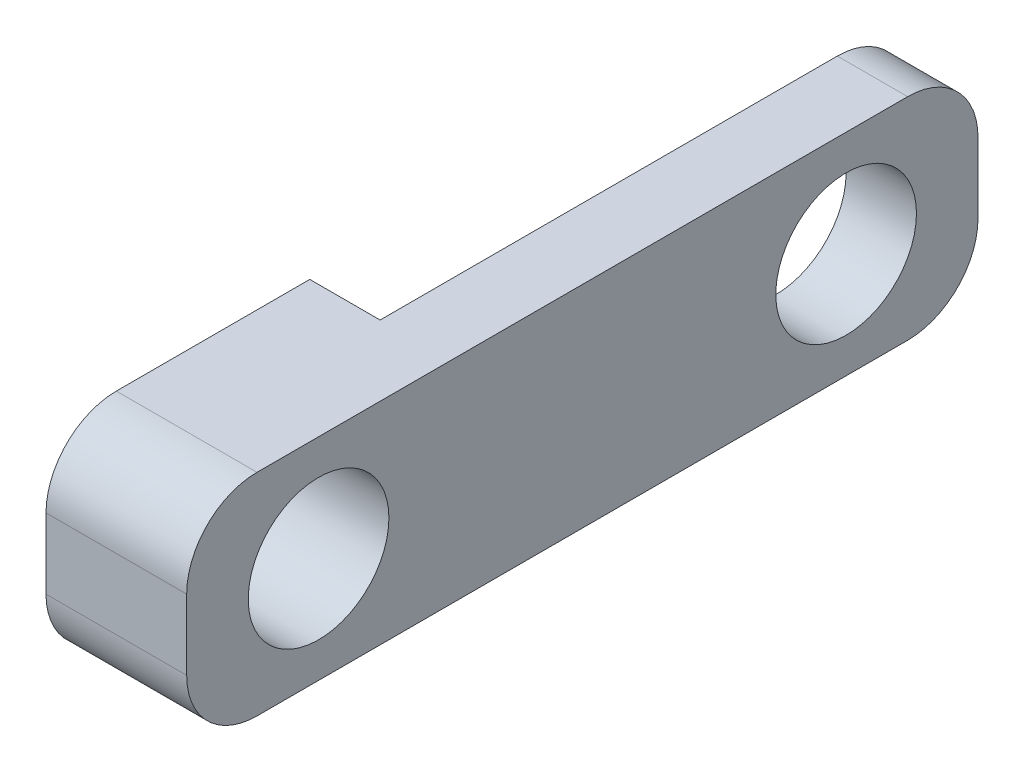
ISO-10303-21;
HEADER;
FILE_DESCRIPTION(('STEP AP214'),'2;1');
FILE_NAME('part.step','',(''),(''),'','','');
FILE_SCHEMA(('AUTOMOTIVE_DESIGN { 1 0 10303 214 1 1 1 1 }'));
ENDSEC;
DATA;
#1=APPLICATION_CONTEXT('core data for automotive mechanical design processes');
#2=APPLICATION_PROTOCOL_DEFINITION('international standard','automotive_design',2000,#1);
#3=PRODUCT_CONTEXT('',#1,'mechanical');
#4=PRODUCT('Part','Part','',(#3));
#5=PRODUCT_RELATED_PRODUCT_CATEGORY('part','',(#4));
#6=PRODUCT_DEFINITION_FORMATION('','',#4);
#7=PRODUCT_DEFINITION_CONTEXT('part definition',#1,'design');
#8=PRODUCT_DEFINITION('design','',#6,#7);
#9=PRODUCT_DEFINITION_SHAPE('','',#8);
#10=(LENGTH_UNIT() NAMED_UNIT(*) SI_UNIT(.MILLI.,.METRE.));
#11=(NAMED_UNIT(*) PLANE_ANGLE_UNIT() SI_UNIT($,.RADIAN.));
#12=(NAMED_UNIT(*) SI_UNIT($,.STERADIAN.) SOLID_ANGLE_UNIT());
#13=UNCERTAINTY_MEASURE_WITH_UNIT(LENGTH_MEASURE(1.E-05),#10,'distance_accuracy_value','');
#14=(GEOMETRIC_REPRESENTATION_CONTEXT(3) GLOBAL_UNCERTAINTY_ASSIGNED_CONTEXT((#13)) GLOBAL_UNIT_ASSIGNED_CONTEXT((#10,
#11,#12)) REPRESENTATION_CONTEXT('',''));
#15=CARTESIAN_POINT('',(0.,0.,0.));
#16=DIRECTION('',(0.,0.,1.));
#17=DIRECTION('',(1.,0.,0.));
#18=AXIS2_PLACEMENT_3D('',#15,#16,#17);
#19=CARTESIAN_POINT('',(8.,6.,-22.5));
#20=DIRECTION('',(0.,0.,1.));
#21=DIRECTION('',(1.,0.,0.));
#22=AXIS2_PLACEMENT_3D('',#19,#20,#21);
#23=PLANE('',#22);
#24=DIRECTION('',(-1.,0.,0.));
#25=VECTOR('',#24,1.);
#26=CARTESIAN_POINT('',(8.,-2.,-22.5));
#27=LINE('',#26,#25);
#28=CARTESIAN_POINT('',(8.,-2.,-22.5));
#29=VERTEX_POINT('',#28);
#30=CARTESIAN_POINT('',(4.,-2.,-22.5));
#31=VERTEX_POINT('',#30);
#32=EDGE_CURVE('E164',#29,#31,#27,.T.);
#33=ORIENTED_EDGE('',*,*,#32,.T.);
#34=DIRECTION('',(0.,1.,0.));
#35=VECTOR('',#34,1.);
#36=CARTESIAN_POINT('',(4.,6.,-22.5));
#37=LINE('',#36,#35);
#38=CARTESIAN_POINT('',(4.,2.,-22.5));
#39=VERTEX_POINT('',#38);
#40=EDGE_CURVE('E212',#31,#39,#37,.T.);
#41=ORIENTED_EDGE('',*,*,#40,.T.);
#42=DIRECTION('',(-1.,0.,0.));
#43=VECTOR('',#42,1.);
#44=CARTESIAN_POINT('',(8.,2.,-22.5));
#45=LINE('',#44,#43);
#46=CARTESIAN_POINT('',(8.,2.,-22.5));
#47=VERTEX_POINT('',#46);
#48=EDGE_CURVE('E161',#39,#47,#45,.F.);
#49=ORIENTED_EDGE('',*,*,#48,.T.);
#50=DIRECTION('',(0.,1.,0.));
#51=VECTOR('',#50,1.);
#52=CARTESIAN_POINT('',(8.,6.,-22.5));
#53=LINE('',#52,#51);
#54=EDGE_CURVE('E160',#29,#47,#53,.T.);
#55=ORIENTED_EDGE('',*,*,#54,.F.);
#56=EDGE_LOOP('',(#33,#41,#49,#55));
#57=FACE_BOUND('',#56,.T.);
#58=ADVANCED_FACE('F39',(#57),#23,.F.);
#59=CARTESIAN_POINT('',(8.,6.,22.5));
#60=DIRECTION('',(0.,-1.,0.));
#61=DIRECTION('',(0.,0.,-1.));
#62=AXIS2_PLACEMENT_3D('',#59,#60,#61);
#63=PLANE('',#62);
#64=DIRECTION('',(-1.,0.,0.));
#65=VECTOR('',#64,1.);
#66=CARTESIAN_POINT('',(8.,6.,-18.5));
#67=LINE('',#66,#65);
#68=CARTESIAN_POINT('',(8.,6.,-18.5));
#69=VERTEX_POINT('',#68);
#70=CARTESIAN_POINT('',(4.,6.,-18.5));
#71=VERTEX_POINT('',#70);
#72=EDGE_CURVE('E48',#69,#71,#67,.T.);
#73=ORIENTED_EDGE('',*,*,#72,.T.);
#74=DIRECTION('',(0.,0.,-1.));
#75=VECTOR('',#74,1.);
#76=CARTESIAN_POINT('',(4.,6.,7.49999999999999));
#77=LINE('',#76,#75);
#78=CARTESIAN_POINT('',(4.,6.,7.49999999999999));
#79=VERTEX_POINT('',#78);
#80=EDGE_CURVE('E54',#79,#71,#77,.T.);
#81=ORIENTED_EDGE('',*,*,#80,.F.);
#82=DIRECTION('',(1.,0.,0.));
#83=VECTOR('',#82,1.);
#84=CARTESIAN_POINT('',(4.,6.,7.49999999999999));
#85=LINE('',#84,#83);
#86=CARTESIAN_POINT('',(0.,6.,7.49999999999999));
#87=VERTEX_POINT('',#86);
#88=EDGE_CURVE('E122',#87,#79,#85,.T.);
#89=ORIENTED_EDGE('',*,*,#88,.F.);
#90=DIRECTION('',(0.,0.,1.));
#91=VECTOR('',#90,1.);
#92=CARTESIAN_POINT('',(0.,6.,22.5));
#93=LINE('',#92,#91);
#94=CARTESIAN_POINT('',(0.,6.,18.5));
#95=VERTEX_POINT('',#94);
#96=EDGE_CURVE('E135',#87,#95,#93,.T.);
#97=ORIENTED_EDGE('',*,*,#96,.T.);
#98=DIRECTION('',(-1.,0.,0.));
#99=VECTOR('',#98,1.);
#100=CARTESIAN_POINT('',(8.,6.,18.5));
#101=LINE('',#100,#99);
#102=CARTESIAN_POINT('',(8.,6.,18.5));
#103=VERTEX_POINT('',#102);
#104=EDGE_CURVE('E198',#95,#103,#101,.F.);
#105=ORIENTED_EDGE('',*,*,#104,.T.);
#106=DIRECTION('',(0.,0.,1.));
#107=VECTOR('',#106,1.);
#108=CARTESIAN_POINT('',(8.,6.,22.5));
#109=LINE('',#108,#107);
#110=EDGE_CURVE('E204',#69,#103,#109,.T.);
#111=ORIENTED_EDGE('',*,*,#110,.F.);
#112=EDGE_LOOP('',(#73,#81,#89,#97,#105,#111));
#113=FACE_BOUND('',#112,.T.);
#114=ADVANCED_FACE('F134',(#113),#63,.F.);
#115=CARTESIAN_POINT('',(8.,6.,22.5));
#116=DIRECTION('',(0.,0.,-1.));
#117=DIRECTION('',(-1.,0.,0.));
#118=AXIS2_PLACEMENT_3D('',#115,#116,#117);
#119=PLANE('',#118);
#120=DIRECTION('',(0.,-1.,0.));
#121=VECTOR('',#120,1.);
#122=CARTESIAN_POINT('',(0.,6.,22.5));
#123=LINE('',#122,#121);
#124=CARTESIAN_POINT('',(0.,2.,22.5));
#125=VERTEX_POINT('',#124);
#126=CARTESIAN_POINT('',(0.,-2.,22.5));
#127=VERTEX_POINT('',#126);
#128=EDGE_CURVE('E144',#125,#127,#123,.T.);
#129=ORIENTED_EDGE('',*,*,#128,.T.);
#130=DIRECTION('',(-1.,0.,0.));
#131=VECTOR('',#130,1.);
#132=CARTESIAN_POINT('',(8.,-2.,22.5));
#133=LINE('',#132,#131);
#134=CARTESIAN_POINT('',(8.,-2.,22.5));
#135=VERTEX_POINT('',#134);
#136=EDGE_CURVE('E62',#127,#135,#133,.F.);
#137=ORIENTED_EDGE('',*,*,#136,.T.);
#138=DIRECTION('',(0.,-1.,0.));
#139=VECTOR('',#138,1.);
#140=CARTESIAN_POINT('',(8.,6.,22.5));
#141=LINE('',#140,#139);
#142=CARTESIAN_POINT('',(8.,2.,22.5));
#143=VERTEX_POINT('',#142);
#144=EDGE_CURVE('E246',#143,#135,#141,.T.);
#145=ORIENTED_EDGE('',*,*,#144,.F.);
#146=DIRECTION('',(-1.,0.,0.));
#147=VECTOR('',#146,1.);
#148=CARTESIAN_POINT('',(8.,2.,22.5));
#149=LINE('',#148,#147);
#150=EDGE_CURVE('E192',#143,#125,#149,.T.);
#151=ORIENTED_EDGE('',*,*,#150,.T.);
#152=EDGE_LOOP('',(#129,#137,#145,#151));
#153=FACE_BOUND('',#152,.T.);
#154=ADVANCED_FACE('F262',(#153),#119,.F.);
#155=CARTESIAN_POINT('',(8.,-6.,22.5));
#156=DIRECTION('',(0.,1.,0.));
#157=DIRECTION('',(0.,0.,1.));
#158=AXIS2_PLACEMENT_3D('',#155,#156,#157);
#159=PLANE('',#158);
#160=DIRECTION('',(1.,0.,0.));
#161=VECTOR('',#160,1.);
#162=CARTESIAN_POINT('',(7.99999999999999,-6.,7.49999999999999));
#163=LINE('',#162,#161);
#164=CARTESIAN_POINT('',(0.,-6.,7.49999999999999));
#165=VERTEX_POINT('',#164);
#166=CARTESIAN_POINT('',(4.,-6.,7.49999999999999));
#167=VERTEX_POINT('',#166);
#168=EDGE_CURVE('E124',#165,#167,#163,.T.);
#169=ORIENTED_EDGE('',*,*,#168,.T.);
#170=DIRECTION('',(0.,0.,-1.));
#171=VECTOR('',#170,1.);
#172=CARTESIAN_POINT('',(4.,-6.,22.5));
#173=LINE('',#172,#171);
#174=CARTESIAN_POINT('',(4.,-6.,-18.5));
#175=VERTEX_POINT('',#174);
#176=EDGE_CURVE('E223',#167,#175,#173,.T.);
#177=ORIENTED_EDGE('',*,*,#176,.T.);
#178=DIRECTION('',(-1.,0.,0.));
#179=VECTOR('',#178,1.);
#180=CARTESIAN_POINT('',(8.,-6.,-18.5));
#181=LINE('',#180,#179);
#182=CARTESIAN_POINT('',(8.,-6.,-18.5));
#183=VERTEX_POINT('',#182);
#184=EDGE_CURVE('E177',#175,#183,#181,.F.);
#185=ORIENTED_EDGE('',*,*,#184,.T.);
#186=DIRECTION('',(0.,0.,-1.));
#187=VECTOR('',#186,1.);
#188=CARTESIAN_POINT('',(8.,-6.,22.5));
#189=LINE('',#188,#187);
#190=CARTESIAN_POINT('',(8.,-6.,18.5));
#191=VERTEX_POINT('',#190);
#192=EDGE_CURVE('E155',#191,#183,#189,.T.);
#193=ORIENTED_EDGE('',*,*,#192,.F.);
#194=DIRECTION('',(-1.,0.,0.));
#195=VECTOR('',#194,1.);
#196=CARTESIAN_POINT('',(8.,-6.,18.5));
#197=LINE('',#196,#195);
#198=CARTESIAN_POINT('',(0.,-6.,18.5));
#199=VERTEX_POINT('',#198);
#200=EDGE_CURVE('E173',#191,#199,#197,.T.);
#201=ORIENTED_EDGE('',*,*,#200,.T.);
#202=DIRECTION('',(0.,0.,-1.));
#203=VECTOR('',#202,1.);
#204=CARTESIAN_POINT('',(0.,-6.,22.5));
#205=LINE('',#204,#203);
#206=EDGE_CURVE('E149',#199,#165,#205,.T.);
#207=ORIENTED_EDGE('',*,*,#206,.T.);
#208=EDGE_LOOP('',(#169,#177,#185,#193,#201,#207));
#209=FACE_BOUND('',#208,.T.);
#210=ADVANCED_FACE('F260',(#209),#159,.F.);
#211=CARTESIAN_POINT('',(8.,0.,0.));
#212=DIRECTION('',(1.,0.,0.));
#213=DIRECTION('',(0.,0.,-1.));
#214=AXIS2_PLACEMENT_3D('',#211,#212,#213);
#215=PLANE('',#214);
#216=CARTESIAN_POINT('',(8.,0.,15.));
#217=DIRECTION('',(1.,0.,0.));
#218=DIRECTION('',(0.,0.,-1.));
#219=AXIS2_PLACEMENT_3D('',#216,#217,#218);
#220=CIRCLE('',#219,4.);
#221=CARTESIAN_POINT('',(8.,0.,11.));
#222=VERTEX_POINT('',#221);
#223=EDGE_CURVE('E152',#222,#222,#220,.T.);
#224=ORIENTED_EDGE('',*,*,#223,.F.);
#225=EDGE_LOOP('',(#224));
#226=FACE_BOUND('',#225,.T.);
#227=CARTESIAN_POINT('',(8.,0.,-15.));
#228=DIRECTION('',(1.,0.,0.));
#229=DIRECTION('',(0.,0.,-1.));
#230=AXIS2_PLACEMENT_3D('',#227,#228,#229);
#231=CIRCLE('',#230,4.);
#232=CARTESIAN_POINT('',(8.,0.,-19.));
#233=VERTEX_POINT('',#232);
#234=EDGE_CURVE('E235',#233,#233,#231,.T.);
#235=ORIENTED_EDGE('',*,*,#234,.F.);
#236=EDGE_LOOP('',(#235));
#237=FACE_BOUND('',#236,.T.);
#238=ORIENTED_EDGE('',*,*,#192,.T.);
#239=CARTESIAN_POINT('',(8.,-2.,-18.5));
#240=DIRECTION('',(1.,0.,0.));
#241=DIRECTION('',(0.,0.,-1.));
#242=AXIS2_PLACEMENT_3D('',#239,#240,#241);
#243=CIRCLE('',#242,4.);
#244=EDGE_CURVE('E189',#183,#29,#243,.T.);
#245=ORIENTED_EDGE('',*,*,#244,.T.);
#246=ORIENTED_EDGE('',*,*,#54,.T.);
#247=CARTESIAN_POINT('',(8.,2.,-18.5));
#248=DIRECTION('',(1.,0.,0.));
#249=DIRECTION('',(0.,0.,-1.));
#250=AXIS2_PLACEMENT_3D('',#247,#248,#249);
#251=CIRCLE('',#250,4.);
#252=EDGE_CURVE('E183',#47,#69,#251,.T.);
#253=ORIENTED_EDGE('',*,*,#252,.T.);
#254=ORIENTED_EDGE('',*,*,#110,.T.);
#255=CARTESIAN_POINT('',(8.,2.,18.5));
#256=DIRECTION('',(1.,0.,0.));
#257=DIRECTION('',(0.,0.,-1.));
#258=AXIS2_PLACEMENT_3D('',#255,#256,#257);
#259=CIRCLE('',#258,4.);
#260=EDGE_CURVE('E180',#103,#143,#259,.T.);
#261=ORIENTED_EDGE('',*,*,#260,.T.);
#262=ORIENTED_EDGE('',*,*,#144,.T.);
#263=CARTESIAN_POINT('',(8.,-2.,18.5));
#264=DIRECTION('',(1.,0.,0.));
#265=DIRECTION('',(0.,0.,-1.));
#266=AXIS2_PLACEMENT_3D('',#263,#264,#265);
#267=CIRCLE('',#266,4.);
#268=EDGE_CURVE('E186',#135,#191,#267,.T.);
#269=ORIENTED_EDGE('',*,*,#268,.T.);
#270=EDGE_LOOP('',(#238,#245,#246,#253,#254,#261,#262,#269));
#271=FACE_BOUND('',#270,.T.);
#272=ADVANCED_FACE('F254',(#226,#237,#271),#215,.T.);
#273=CARTESIAN_POINT('',(0.,0.,0.));
#274=DIRECTION('',(1.,0.,0.));
#275=DIRECTION('',(0.,0.,-1.));
#276=AXIS2_PLACEMENT_3D('',#273,#274,#275);
#277=PLANE('',#276);
#278=CARTESIAN_POINT('',(0.,0.,15.));
#279=DIRECTION('',(1.,0.,0.));
#280=DIRECTION('',(0.,0.,-1.));
#281=AXIS2_PLACEMENT_3D('',#278,#279,#280);
#282=CIRCLE('',#281,4.);
#283=CARTESIAN_POINT('',(0.,0.,11.));
#284=VERTEX_POINT('',#283);
#285=EDGE_CURVE('E145',#284,#284,#282,.T.);
#286=ORIENTED_EDGE('',*,*,#285,.T.);
#287=EDGE_LOOP('',(#286));
#288=FACE_BOUND('',#287,.T.);
#289=ORIENTED_EDGE('',*,*,#96,.F.);
#290=DIRECTION('',(0.,1.,0.));
#291=VECTOR('',#290,1.);
#292=CARTESIAN_POINT('',(0.,-10.,7.49999999999999));
#293=LINE('',#292,#291);
#294=EDGE_CURVE('E118',#165,#87,#293,.T.);
#295=ORIENTED_EDGE('',*,*,#294,.F.);
#296=ORIENTED_EDGE('',*,*,#206,.F.);
#297=CARTESIAN_POINT('',(0.,-2.,18.5));
#298=DIRECTION('',(1.,0.,0.));
#299=DIRECTION('',(0.,0.,-1.));
#300=AXIS2_PLACEMENT_3D('',#297,#298,#299);
#301=CIRCLE('',#300,4.);
#302=EDGE_CURVE('E170',#199,#127,#301,.F.);
#303=ORIENTED_EDGE('',*,*,#302,.T.);
#304=ORIENTED_EDGE('',*,*,#128,.F.);
#305=CARTESIAN_POINT('',(0.,2.,18.5));
#306=DIRECTION('',(1.,0.,0.));
#307=DIRECTION('',(0.,0.,-1.));
#308=AXIS2_PLACEMENT_3D('',#305,#306,#307);
#309=CIRCLE('',#308,4.);
#310=EDGE_CURVE('E141',#125,#95,#309,.F.);
#311=ORIENTED_EDGE('',*,*,#310,.T.);
#312=EDGE_LOOP('',(#289,#295,#296,#303,#304,#311));
#313=FACE_BOUND('',#312,.T.);
#314=ADVANCED_FACE('F139',(#288,#313),#277,.F.);
#315=CARTESIAN_POINT('',(0.,0.,-15.));
#316=DIRECTION('',(1.,0.,0.));
#317=DIRECTION('',(0.,0.,-1.));
#318=AXIS2_PLACEMENT_3D('',#315,#316,#317);
#319=CYLINDRICAL_SURFACE('',#318,4.);
#320=CARTESIAN_POINT('',(4.,0.,-15.));
#321=DIRECTION('',(1.,0.,0.));
#322=DIRECTION('',(0.,0.,-1.));
#323=AXIS2_PLACEMENT_3D('',#320,#321,#322);
#324=CIRCLE('',#323,4.);
#325=CARTESIAN_POINT('',(4.,0.,-19.));
#326=VERTEX_POINT('',#325);
#327=EDGE_CURVE('E230',#326,#326,#324,.F.);
#328=ORIENTED_EDGE('',*,*,#327,.T.);
#329=EDGE_LOOP('',(#328));
#330=FACE_BOUND('',#329,.T.);
#331=ORIENTED_EDGE('',*,*,#234,.T.);
#332=EDGE_LOOP('',(#331));
#333=FACE_BOUND('',#332,.T.);
#334=ADVANCED_FACE('F286',(#330,#333),#319,.F.);
#335=CARTESIAN_POINT('',(0.,0.,15.));
#336=DIRECTION('',(1.,0.,0.));
#337=DIRECTION('',(0.,0.,-1.));
#338=AXIS2_PLACEMENT_3D('',#335,#336,#337);
#339=CYLINDRICAL_SURFACE('',#338,4.);
#340=ORIENTED_EDGE('',*,*,#285,.F.);
#341=EDGE_LOOP('',(#340));
#342=FACE_BOUND('',#341,.T.);
#343=ORIENTED_EDGE('',*,*,#223,.T.);
#344=EDGE_LOOP('',(#343));
#345=FACE_BOUND('',#344,.T.);
#346=ADVANCED_FACE('F271',(#342,#345),#339,.F.);
#347=CARTESIAN_POINT('',(8.,-2.,-18.5));
#348=DIRECTION('',(-1.,0.,0.));
#349=DIRECTION('',(0.,0.,1.));
#350=AXIS2_PLACEMENT_3D('',#347,#348,#349);
#351=CYLINDRICAL_SURFACE('',#350,4.);
#352=CARTESIAN_POINT('',(4.,-2.,-18.5));
#353=DIRECTION('',(1.,0.,0.));
#354=DIRECTION('',(0.,0.,-1.));
#355=AXIS2_PLACEMENT_3D('',#352,#353,#354);
#356=CIRCLE('',#355,4.);
#357=EDGE_CURVE('E219',#31,#175,#356,.F.);
#358=ORIENTED_EDGE('',*,*,#357,.F.);
#359=ORIENTED_EDGE('',*,*,#32,.F.);
#360=ORIENTED_EDGE('',*,*,#244,.F.);
#361=ORIENTED_EDGE('',*,*,#184,.F.);
#362=EDGE_LOOP('',(#358,#359,#360,#361));
#363=FACE_BOUND('',#362,.T.);
#364=ADVANCED_FACE('F259',(#363),#351,.T.);
#365=CARTESIAN_POINT('',(8.,-2.,18.5));
#366=DIRECTION('',(-1.,0.,0.));
#367=DIRECTION('',(0.,0.,1.));
#368=AXIS2_PLACEMENT_3D('',#365,#366,#367);
#369=CYLINDRICAL_SURFACE('',#368,4.);
#370=ORIENTED_EDGE('',*,*,#268,.F.);
#371=ORIENTED_EDGE('',*,*,#136,.F.);
#372=ORIENTED_EDGE('',*,*,#302,.F.);
#373=ORIENTED_EDGE('',*,*,#200,.F.);
#374=EDGE_LOOP('',(#370,#371,#372,#373));
#375=FACE_BOUND('',#374,.T.);
#376=ADVANCED_FACE('F264',(#375),#369,.T.);
#377=CARTESIAN_POINT('',(8.,2.,-18.5));
#378=DIRECTION('',(-1.,0.,0.));
#379=DIRECTION('',(0.,0.,1.));
#380=AXIS2_PLACEMENT_3D('',#377,#378,#379);
#381=CYLINDRICAL_SURFACE('',#380,4.);
#382=CARTESIAN_POINT('',(4.,2.,-18.5));
#383=DIRECTION('',(1.,0.,0.));
#384=DIRECTION('',(0.,0.,-1.));
#385=AXIS2_PLACEMENT_3D('',#382,#383,#384);
#386=CIRCLE('',#385,4.);
#387=EDGE_CURVE('E11',#71,#39,#386,.F.);
#388=ORIENTED_EDGE('',*,*,#387,.F.);
#389=ORIENTED_EDGE('',*,*,#72,.F.);
#390=ORIENTED_EDGE('',*,*,#252,.F.);
#391=ORIENTED_EDGE('',*,*,#48,.F.);
#392=EDGE_LOOP('',(#388,#389,#390,#391));
#393=FACE_BOUND('',#392,.T.);
#394=ADVANCED_FACE('F207',(#393),#381,.T.);
#395=CARTESIAN_POINT('',(8.,2.,18.5));
#396=DIRECTION('',(-1.,0.,0.));
#397=DIRECTION('',(0.,0.,1.));
#398=AXIS2_PLACEMENT_3D('',#395,#396,#397);
#399=CYLINDRICAL_SURFACE('',#398,4.);
#400=ORIENTED_EDGE('',*,*,#260,.F.);
#401=ORIENTED_EDGE('',*,*,#104,.F.);
#402=ORIENTED_EDGE('',*,*,#310,.F.);
#403=ORIENTED_EDGE('',*,*,#150,.F.);
#404=EDGE_LOOP('',(#400,#401,#402,#403));
#405=FACE_BOUND('',#404,.T.);
#406=ADVANCED_FACE('F41',(#405),#399,.T.);
#407=CARTESIAN_POINT('',(4.,-10.,7.49999999999999));
#408=DIRECTION('',(0.,0.,1.));
#409=DIRECTION('',(1.,0.,0.));
#410=AXIS2_PLACEMENT_3D('',#407,#408,#409);
#411=PLANE('',#410);
#412=ORIENTED_EDGE('',*,*,#294,.T.);
#413=ORIENTED_EDGE('',*,*,#88,.T.);
#414=DIRECTION('',(0.,1.,0.));
#415=VECTOR('',#414,1.);
#416=CARTESIAN_POINT('',(4.,-10.,7.49999999999999));
#417=LINE('',#416,#415);
#418=EDGE_CURVE('E130',#167,#79,#417,.T.);
#419=ORIENTED_EDGE('',*,*,#418,.F.);
#420=ORIENTED_EDGE('',*,*,#168,.F.);
#421=EDGE_LOOP('',(#412,#413,#419,#420));
#422=FACE_BOUND('',#421,.T.);
#423=ADVANCED_FACE('F120',(#422),#411,.F.);
#424=CARTESIAN_POINT('',(4.,-10.,7.49999999999999));
#425=DIRECTION('',(1.,0.,0.));
#426=DIRECTION('',(0.,0.,-1.));
#427=AXIS2_PLACEMENT_3D('',#424,#425,#426);
#428=PLANE('',#427);
#429=ORIENTED_EDGE('',*,*,#418,.T.);
#430=ORIENTED_EDGE('',*,*,#80,.T.);
#431=ORIENTED_EDGE('',*,*,#387,.T.);
#432=ORIENTED_EDGE('',*,*,#40,.F.);
#433=ORIENTED_EDGE('',*,*,#357,.T.);
#434=ORIENTED_EDGE('',*,*,#176,.F.);
#435=EDGE_LOOP('',(#429,#430,#431,#432,#433,#434));
#436=FACE_BOUND('',#435,.T.);
#437=ORIENTED_EDGE('',*,*,#327,.F.);
#438=EDGE_LOOP('',(#437));
#439=FACE_BOUND('',#438,.T.);
#440=ADVANCED_FACE('F210',(#436,#439),#428,.F.);
#441=CLOSED_SHELL('',(#58,#114,#154,#210,#272,#314,#334,#346,#364,#376,#394,#406,#423,#440));
#442=MANIFOLD_SOLID_BREP('B2',#441);
#443=ADVANCED_BREP_SHAPE_REPRESENTATION('',(#18,#442),#14);
#444=SHAPE_DEFINITION_REPRESENTATION(#9,#443);
ENDSEC;
END-ISO-10303-21;
